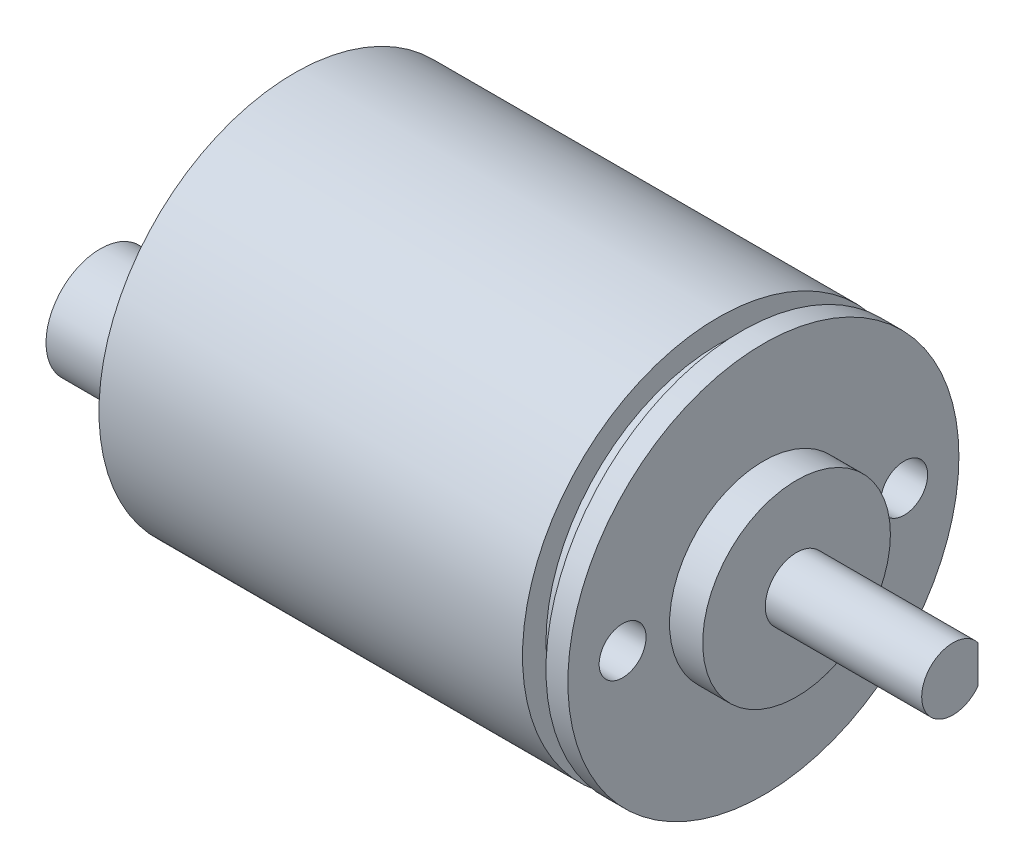
ISO-10303-21;
HEADER;
FILE_DESCRIPTION(('STEP AP214'),'2;1');
FILE_NAME('part.step','',(''),(''),'','','');
FILE_SCHEMA(('AUTOMOTIVE_DESIGN { 1 0 10303 214 1 1 1 1 }'));
ENDSEC;
DATA;
#1=APPLICATION_CONTEXT('core data for automotive mechanical design processes');
#2=APPLICATION_PROTOCOL_DEFINITION('international standard','automotive_design',2000,#1);
#3=PRODUCT_CONTEXT('',#1,'mechanical');
#4=PRODUCT('Part','Part','',(#3));
#5=PRODUCT_RELATED_PRODUCT_CATEGORY('part','',(#4));
#6=PRODUCT_DEFINITION_FORMATION('','',#4);
#7=PRODUCT_DEFINITION_CONTEXT('part definition',#1,'design');
#8=PRODUCT_DEFINITION('design','',#6,#7);
#9=PRODUCT_DEFINITION_SHAPE('','',#8);
#10=(LENGTH_UNIT() NAMED_UNIT(*) SI_UNIT(.MILLI.,.METRE.));
#11=(NAMED_UNIT(*) PLANE_ANGLE_UNIT() SI_UNIT($,.RADIAN.));
#12=(NAMED_UNIT(*) SI_UNIT($,.STERADIAN.) SOLID_ANGLE_UNIT());
#13=UNCERTAINTY_MEASURE_WITH_UNIT(LENGTH_MEASURE(1.E-05),#10,'distance_accuracy_value','');
#14=(GEOMETRIC_REPRESENTATION_CONTEXT(3) GLOBAL_UNCERTAINTY_ASSIGNED_CONTEXT((#13)) GLOBAL_UNIT_ASSIGNED_CONTEXT((#10,
#11,#12)) REPRESENTATION_CONTEXT('',''));
#15=CARTESIAN_POINT('',(0.,0.,0.));
#16=DIRECTION('',(0.,0.,1.));
#17=DIRECTION('',(1.,0.,0.));
#18=AXIS2_PLACEMENT_3D('',#15,#16,#17);
#19=CARTESIAN_POINT('',(0.,0.,0.));
#20=DIRECTION('',(1.,0.,0.));
#21=DIRECTION('',(0.,0.,-1.));
#22=AXIS2_PLACEMENT_3D('',#19,#20,#21);
#23=PLANE('',#22);
#24=CARTESIAN_POINT('',(0.,0.,0.));
#25=DIRECTION('',(1.,0.,0.));
#26=DIRECTION('',(0.,0.,-1.));
#27=AXIS2_PLACEMENT_3D('',#24,#25,#26);
#28=CIRCLE('',#27,12.5);
#29=CARTESIAN_POINT('',(0.,0.,-12.5));
#30=VERTEX_POINT('',#29);
#31=EDGE_CURVE('E97',#30,#30,#28,.T.);
#32=ORIENTED_EDGE('',*,*,#31,.F.);
#33=EDGE_LOOP('',(#32));
#34=FACE_BOUND('',#33,.T.);
#35=CARTESIAN_POINT('',(0.,0.,6.91455735606405));
#36=DIRECTION('',(1.,0.,0.));
#37=DIRECTION('',(0.,0.,-1.));
#38=AXIS2_PLACEMENT_3D('',#35,#36,#37);
#39=CIRCLE('',#38,3.47136815867395);
#40=CARTESIAN_POINT('',(0.,0.,3.44318919739011));
#41=VERTEX_POINT('',#40);
#42=EDGE_CURVE('E11',#41,#41,#39,.F.);
#43=ORIENTED_EDGE('',*,*,#42,.F.);
#44=EDGE_LOOP('',(#43));
#45=FACE_BOUND('',#44,.T.);
#46=ADVANCED_FACE('F34',(#34,#45),#23,.F.);
#47=CARTESIAN_POINT('',(32.0964,0.,0.));
#48=DIRECTION('',(1.,0.,0.));
#49=DIRECTION('',(0.,0.,-1.));
#50=AXIS2_PLACEMENT_3D('',#47,#48,#49);
#51=PLANE('',#50);
#52=CARTESIAN_POINT('',(32.0964,0.,0.));
#53=DIRECTION('',(1.,0.,0.));
#54=DIRECTION('',(0.,0.,-1.));
#55=AXIS2_PLACEMENT_3D('',#52,#53,#54);
#56=CIRCLE('',#55,6.);
#57=CARTESIAN_POINT('',(32.0964,0.,-6.));
#58=VERTEX_POINT('',#57);
#59=EDGE_CURVE('E79',#58,#58,#56,.T.);
#60=ORIENTED_EDGE('',*,*,#59,.T.);
#61=EDGE_LOOP('',(#60));
#62=FACE_BOUND('',#61,.T.);
#63=CARTESIAN_POINT('',(32.0964,0.,0.));
#64=DIRECTION('',(1.,0.,0.));
#65=DIRECTION('',(0.,0.,-1.));
#66=AXIS2_PLACEMENT_3D('',#63,#64,#65);
#67=CIRCLE('',#66,2.);
#68=CARTESIAN_POINT('',(32.0964,0.,-2.));
#69=VERTEX_POINT('',#68);
#70=EDGE_CURVE('E76',#69,#69,#67,.T.);
#71=ORIENTED_EDGE('',*,*,#70,.F.);
#72=EDGE_LOOP('',(#71));
#73=FACE_BOUND('',#72,.T.);
#74=ADVANCED_FACE('F133',(#62,#73),#51,.T.);
#75=CARTESIAN_POINT('',(29.9764,0.,0.));
#76=DIRECTION('',(1.,0.,0.));
#77=DIRECTION('',(0.,0.,-1.));
#78=AXIS2_PLACEMENT_3D('',#75,#76,#77);
#79=PLANE('',#78);
#80=CARTESIAN_POINT('',(29.9764,0.,9.));
#81=DIRECTION('',(1.,0.,0.));
#82=DIRECTION('',(0.,0.,-1.));
#83=AXIS2_PLACEMENT_3D('',#80,#81,#82);
#84=CIRCLE('',#83,1.5);
#85=CARTESIAN_POINT('',(29.9764,0.,7.5));
#86=VERTEX_POINT('',#85);
#87=EDGE_CURVE('E114',#86,#86,#84,.T.);
#88=ORIENTED_EDGE('',*,*,#87,.F.);
#89=EDGE_LOOP('',(#88));
#90=FACE_BOUND('',#89,.T.);
#91=CARTESIAN_POINT('',(29.9764,0.,-9.));
#92=DIRECTION('',(1.,0.,0.));
#93=DIRECTION('',(0.,0.,-1.));
#94=AXIS2_PLACEMENT_3D('',#91,#92,#93);
#95=CIRCLE('',#94,1.5);
#96=CARTESIAN_POINT('',(29.9764,0.,-10.5));
#97=VERTEX_POINT('',#96);
#98=EDGE_CURVE('E108',#97,#97,#95,.T.);
#99=ORIENTED_EDGE('',*,*,#98,.F.);
#100=EDGE_LOOP('',(#99));
#101=FACE_BOUND('',#100,.T.);
#102=CARTESIAN_POINT('',(29.9764,0.,0.));
#103=DIRECTION('',(1.,0.,0.));
#104=DIRECTION('',(0.,0.,-1.));
#105=AXIS2_PLACEMENT_3D('',#102,#103,#104);
#106=CIRCLE('',#105,12.5);
#107=CARTESIAN_POINT('',(29.9764,0.,-12.5));
#108=VERTEX_POINT('',#107);
#109=EDGE_CURVE('E88',#108,#108,#106,.T.);
#110=ORIENTED_EDGE('',*,*,#109,.T.);
#111=EDGE_LOOP('',(#110));
#112=FACE_BOUND('',#111,.T.);
#113=CARTESIAN_POINT('',(29.9764,0.,0.));
#114=DIRECTION('',(1.,0.,0.));
#115=DIRECTION('',(0.,0.,-1.));
#116=AXIS2_PLACEMENT_3D('',#113,#114,#115);
#117=CIRCLE('',#116,6.);
#118=CARTESIAN_POINT('',(29.9764,0.,-6.));
#119=VERTEX_POINT('',#118);
#120=EDGE_CURVE('E75',#119,#119,#117,.T.);
#121=ORIENTED_EDGE('',*,*,#120,.F.);
#122=EDGE_LOOP('',(#121));
#123=FACE_BOUND('',#122,.T.);
#124=ADVANCED_FACE('F138',(#90,#101,#112,#123),#79,.T.);
#125=CARTESIAN_POINT('',(27.0764,0.,0.));
#126=DIRECTION('',(1.,0.,0.));
#127=DIRECTION('',(0.,0.,-1.));
#128=AXIS2_PLACEMENT_3D('',#125,#126,#127);
#129=PLANE('',#128);
#130=CARTESIAN_POINT('',(27.0764,0.,0.));
#131=DIRECTION('',(1.,0.,0.));
#132=DIRECTION('',(0.,0.,-1.));
#133=AXIS2_PLACEMENT_3D('',#130,#131,#132);
#134=CIRCLE('',#133,12.5);
#135=CARTESIAN_POINT('',(27.0764,0.,-12.5));
#136=VERTEX_POINT('',#135);
#137=EDGE_CURVE('E65',#136,#136,#134,.T.);
#138=ORIENTED_EDGE('',*,*,#137,.T.);
#139=EDGE_LOOP('',(#138));
#140=FACE_BOUND('',#139,.T.);
#141=CARTESIAN_POINT('',(27.0764,0.,0.));
#142=DIRECTION('',(1.,0.,0.));
#143=DIRECTION('',(0.,0.,-1.));
#144=AXIS2_PLACEMENT_3D('',#141,#142,#143);
#145=CIRCLE('',#144,11.);
#146=CARTESIAN_POINT('',(27.0764,0.,-11.));
#147=VERTEX_POINT('',#146);
#148=EDGE_CURVE('E91',#147,#147,#145,.T.);
#149=ORIENTED_EDGE('',*,*,#148,.F.);
#150=EDGE_LOOP('',(#149));
#151=FACE_BOUND('',#150,.T.);
#152=ADVANCED_FACE('F143',(#140,#151),#129,.T.);
#153=CARTESIAN_POINT('',(27.0764,0.,0.));
#154=DIRECTION('',(-1.,0.,0.));
#155=DIRECTION('',(0.,0.,1.));
#156=AXIS2_PLACEMENT_3D('',#153,#154,#155);
#157=CYLINDRICAL_SURFACE('',#156,12.5);
#158=ORIENTED_EDGE('',*,*,#137,.F.);
#159=EDGE_LOOP('',(#158));
#160=FACE_BOUND('',#159,.T.);
#161=ORIENTED_EDGE('',*,*,#31,.T.);
#162=EDGE_LOOP('',(#161));
#163=FACE_BOUND('',#162,.T.);
#164=ADVANCED_FACE('F36',(#160,#163),#157,.T.);
#165=CARTESIAN_POINT('',(28.5764,0.,0.));
#166=DIRECTION('',(-1.,0.,0.));
#167=DIRECTION('',(0.,0.,1.));
#168=AXIS2_PLACEMENT_3D('',#165,#166,#167);
#169=CYLINDRICAL_SURFACE('',#168,11.);
#170=CARTESIAN_POINT('',(28.5764,0.,0.));
#171=DIRECTION('',(1.,0.,0.));
#172=DIRECTION('',(0.,0.,-1.));
#173=AXIS2_PLACEMENT_3D('',#170,#171,#172);
#174=CIRCLE('',#173,11.);
#175=CARTESIAN_POINT('',(28.5764,0.,-11.));
#176=VERTEX_POINT('',#175);
#177=EDGE_CURVE('E94',#176,#176,#174,.T.);
#178=ORIENTED_EDGE('',*,*,#177,.F.);
#179=EDGE_LOOP('',(#178));
#180=FACE_BOUND('',#179,.T.);
#181=ORIENTED_EDGE('',*,*,#148,.T.);
#182=EDGE_LOOP('',(#181));
#183=FACE_BOUND('',#182,.T.);
#184=ADVANCED_FACE('F147',(#180,#183),#169,.T.);
#185=CARTESIAN_POINT('',(28.5764,0.,0.));
#186=DIRECTION('',(1.,0.,0.));
#187=DIRECTION('',(0.,0.,-1.));
#188=AXIS2_PLACEMENT_3D('',#185,#186,#187);
#189=PLANE('',#188);
#190=CARTESIAN_POINT('',(28.5764,0.,0.));
#191=DIRECTION('',(1.,0.,0.));
#192=DIRECTION('',(0.,0.,-1.));
#193=AXIS2_PLACEMENT_3D('',#190,#191,#192);
#194=CIRCLE('',#193,12.5);
#195=CARTESIAN_POINT('',(28.5764,0.,-12.5));
#196=VERTEX_POINT('',#195);
#197=EDGE_CURVE('E86',#196,#196,#194,.T.);
#198=ORIENTED_EDGE('',*,*,#197,.F.);
#199=EDGE_LOOP('',(#198));
#200=FACE_BOUND('',#199,.T.);
#201=ORIENTED_EDGE('',*,*,#177,.T.);
#202=EDGE_LOOP('',(#201));
#203=FACE_BOUND('',#202,.T.);
#204=ADVANCED_FACE('F150',(#200,#203),#189,.F.);
#205=CARTESIAN_POINT('',(29.9764,0.,0.));
#206=DIRECTION('',(-1.,0.,0.));
#207=DIRECTION('',(0.,0.,1.));
#208=AXIS2_PLACEMENT_3D('',#205,#206,#207);
#209=CYLINDRICAL_SURFACE('',#208,12.5);
#210=ORIENTED_EDGE('',*,*,#109,.F.);
#211=EDGE_LOOP('',(#210));
#212=FACE_BOUND('',#211,.T.);
#213=ORIENTED_EDGE('',*,*,#197,.T.);
#214=EDGE_LOOP('',(#213));
#215=FACE_BOUND('',#214,.T.);
#216=ADVANCED_FACE('F152',(#212,#215),#209,.T.);
#217=CARTESIAN_POINT('',(32.0964,0.,0.));
#218=DIRECTION('',(-1.,0.,0.));
#219=DIRECTION('',(0.,0.,1.));
#220=AXIS2_PLACEMENT_3D('',#217,#218,#219);
#221=CYLINDRICAL_SURFACE('',#220,6.);
#222=ORIENTED_EDGE('',*,*,#59,.F.);
#223=EDGE_LOOP('',(#222));
#224=FACE_BOUND('',#223,.T.);
#225=ORIENTED_EDGE('',*,*,#120,.T.);
#226=EDGE_LOOP('',(#225));
#227=FACE_BOUND('',#226,.T.);
#228=ADVANCED_FACE('F155',(#224,#227),#221,.T.);
#229=CARTESIAN_POINT('',(42.0964,0.,0.));
#230=DIRECTION('',(-1.,0.,0.));
#231=DIRECTION('',(0.,0.,1.));
#232=AXIS2_PLACEMENT_3D('',#229,#230,#231);
#233=CYLINDRICAL_SURFACE('',#232,2.);
#234=CARTESIAN_POINT('',(42.0964,0.,0.));
#235=DIRECTION('',(1.,0.,0.));
#236=DIRECTION('',(0.,0.,-1.));
#237=AXIS2_PLACEMENT_3D('',#234,#235,#236);
#238=CIRCLE('',#237,2.);
#239=CARTESIAN_POINT('',(42.0964,1.2,-1.6));
#240=VERTEX_POINT('',#239);
#241=CARTESIAN_POINT('',(42.0964,-1.2,-1.6));
#242=VERTEX_POINT('',#241);
#243=EDGE_CURVE('E71',#240,#242,#238,.T.);
#244=ORIENTED_EDGE('',*,*,#243,.F.);
#245=DIRECTION('',(-1.,0.,0.));
#246=VECTOR('',#245,1.);
#247=CARTESIAN_POINT('',(42.0964,1.2,-1.6));
#248=LINE('',#247,#246);
#249=CARTESIAN_POINT('',(34.0964,1.2,-1.6));
#250=VERTEX_POINT('',#249);
#251=EDGE_CURVE('E49',#240,#250,#248,.T.);
#252=ORIENTED_EDGE('',*,*,#251,.T.);
#253=CARTESIAN_POINT('',(34.0964,0.,0.));
#254=DIRECTION('',(1.,0.,0.));
#255=DIRECTION('',(0.,0.,-1.));
#256=AXIS2_PLACEMENT_3D('',#253,#254,#255);
#257=CIRCLE('',#256,2.);
#258=CARTESIAN_POINT('',(34.0964,-1.2,-1.6));
#259=VERTEX_POINT('',#258);
#260=EDGE_CURVE('E42',#259,#250,#257,.T.);
#261=ORIENTED_EDGE('',*,*,#260,.F.);
#262=DIRECTION('',(-1.,0.,0.));
#263=VECTOR('',#262,1.);
#264=CARTESIAN_POINT('',(42.0964,-1.2,-1.6));
#265=LINE('',#264,#263);
#266=EDGE_CURVE('E54',#259,#242,#265,.F.);
#267=ORIENTED_EDGE('',*,*,#266,.T.);
#268=EDGE_LOOP('',(#244,#252,#261,#267));
#269=FACE_BOUND('',#268,.T.);
#270=ORIENTED_EDGE('',*,*,#70,.T.);
#271=EDGE_LOOP('',(#270));
#272=FACE_BOUND('',#271,.T.);
#273=ADVANCED_FACE('F69',(#269,#272),#233,.T.);
#274=CARTESIAN_POINT('',(42.0964,0.,0.));
#275=DIRECTION('',(1.,0.,0.));
#276=DIRECTION('',(0.,0.,-1.));
#277=AXIS2_PLACEMENT_3D('',#274,#275,#276);
#278=PLANE('',#277);
#279=DIRECTION('',(0.,-1.,0.));
#280=VECTOR('',#279,1.);
#281=CARTESIAN_POINT('',(42.0964,0.,-1.6));
#282=LINE('',#281,#280);
#283=EDGE_CURVE('E60',#240,#242,#282,.T.);
#284=ORIENTED_EDGE('',*,*,#283,.F.);
#285=ORIENTED_EDGE('',*,*,#243,.T.);
#286=EDGE_LOOP('',(#284,#285));
#287=FACE_BOUND('',#286,.T.);
#288=ADVANCED_FACE('F74',(#287),#278,.T.);
#289=CARTESIAN_POINT('',(34.0964,-3.39264034417219,-1.6));
#290=DIRECTION('',(1.,0.,0.));
#291=DIRECTION('',(0.,0.,-1.));
#292=AXIS2_PLACEMENT_3D('',#289,#290,#291);
#293=PLANE('',#292);
#294=ORIENTED_EDGE('',*,*,#260,.T.);
#295=DIRECTION('',(0.,-1.,0.));
#296=VECTOR('',#295,1.);
#297=CARTESIAN_POINT('',(34.0964,3.27174151376575,-1.6));
#298=LINE('',#297,#296);
#299=EDGE_CURVE('E72',#250,#259,#298,.T.);
#300=ORIENTED_EDGE('',*,*,#299,.T.);
#301=EDGE_LOOP('',(#294,#300));
#302=FACE_BOUND('',#301,.T.);
#303=ADVANCED_FACE('F104',(#302),#293,.T.);
#304=CARTESIAN_POINT('',(34.0964,3.27174151376575,-1.6));
#305=DIRECTION('',(0.,0.,1.));
#306=DIRECTION('',(0.,-1.,0.));
#307=AXIS2_PLACEMENT_3D('',#304,#305,#306);
#308=PLANE('',#307);
#309=ORIENTED_EDGE('',*,*,#283,.T.);
#310=ORIENTED_EDGE('',*,*,#266,.F.);
#311=ORIENTED_EDGE('',*,*,#299,.F.);
#312=ORIENTED_EDGE('',*,*,#251,.F.);
#313=EDGE_LOOP('',(#309,#310,#311,#312));
#314=FACE_BOUND('',#313,.T.);
#315=ADVANCED_FACE('F61',(#314),#308,.F.);
#316=CARTESIAN_POINT('',(23.6264,0.,-9.));
#317=DIRECTION('',(1.,0.,0.));
#318=DIRECTION('',(0.,0.,-1.));
#319=AXIS2_PLACEMENT_3D('',#316,#317,#318);
#320=CYLINDRICAL_SURFACE('',#319,1.5);
#321=CARTESIAN_POINT('',(23.6264,0.,-9.));
#322=DIRECTION('',(1.,0.,0.));
#323=DIRECTION('',(0.,0.,-1.));
#324=AXIS2_PLACEMENT_3D('',#321,#322,#323);
#325=CIRCLE('',#324,1.5);
#326=CARTESIAN_POINT('',(23.6264,0.,-10.5));
#327=VERTEX_POINT('',#326);
#328=EDGE_CURVE('E105',#327,#327,#325,.T.);
#329=ORIENTED_EDGE('',*,*,#328,.F.);
#330=EDGE_LOOP('',(#329));
#331=FACE_BOUND('',#330,.T.);
#332=ORIENTED_EDGE('',*,*,#98,.T.);
#333=EDGE_LOOP('',(#332));
#334=FACE_BOUND('',#333,.T.);
#335=ADVANCED_FACE('F172',(#331,#334),#320,.F.);
#336=CARTESIAN_POINT('',(23.6264,0.,-9.));
#337=DIRECTION('',(1.,0.,0.));
#338=DIRECTION('',(0.,0.,-1.));
#339=AXIS2_PLACEMENT_3D('',#336,#337,#338);
#340=PLANE('',#339);
#341=ORIENTED_EDGE('',*,*,#328,.T.);
#342=EDGE_LOOP('',(#341));
#343=FACE_BOUND('',#342,.T.);
#344=ADVANCED_FACE('F177',(#343),#340,.T.);
#345=CARTESIAN_POINT('',(23.6264,0.,9.));
#346=DIRECTION('',(1.,0.,0.));
#347=DIRECTION('',(0.,0.,-1.));
#348=AXIS2_PLACEMENT_3D('',#345,#346,#347);
#349=CYLINDRICAL_SURFACE('',#348,1.5);
#350=CARTESIAN_POINT('',(23.6264,0.,9.));
#351=DIRECTION('',(1.,0.,0.));
#352=DIRECTION('',(0.,0.,-1.));
#353=AXIS2_PLACEMENT_3D('',#350,#351,#352);
#354=CIRCLE('',#353,1.5);
#355=CARTESIAN_POINT('',(23.6264,0.,7.5));
#356=VERTEX_POINT('',#355);
#357=EDGE_CURVE('E112',#356,#356,#354,.T.);
#358=ORIENTED_EDGE('',*,*,#357,.F.);
#359=EDGE_LOOP('',(#358));
#360=FACE_BOUND('',#359,.T.);
#361=ORIENTED_EDGE('',*,*,#87,.T.);
#362=EDGE_LOOP('',(#361));
#363=FACE_BOUND('',#362,.T.);
#364=ADVANCED_FACE('F181',(#360,#363),#349,.F.);
#365=CARTESIAN_POINT('',(23.6264,0.,9.));
#366=DIRECTION('',(1.,0.,0.));
#367=DIRECTION('',(0.,0.,-1.));
#368=AXIS2_PLACEMENT_3D('',#365,#366,#367);
#369=PLANE('',#368);
#370=ORIENTED_EDGE('',*,*,#357,.T.);
#371=EDGE_LOOP('',(#370));
#372=FACE_BOUND('',#371,.T.);
#373=ADVANCED_FACE('F128',(#372),#369,.T.);
#374=CARTESIAN_POINT('',(-5.5,0.,6.91455735606405));
#375=DIRECTION('',(1.,0.,0.));
#376=DIRECTION('',(0.,0.,-1.));
#377=AXIS2_PLACEMENT_3D('',#374,#375,#376);
#378=CYLINDRICAL_SURFACE('',#377,3.47136815867395);
#379=CARTESIAN_POINT('',(-5.5,0.,6.91455735606405));
#380=DIRECTION('',(-1.,0.,0.));
#381=DIRECTION('',(0.,0.,1.));
#382=AXIS2_PLACEMENT_3D('',#379,#380,#381);
#383=CIRCLE('',#382,3.47136815867395);
#384=CARTESIAN_POINT('',(-5.5,0.,10.385925514738));
#385=VERTEX_POINT('',#384);
#386=EDGE_CURVE('E117',#385,#385,#383,.T.);
#387=ORIENTED_EDGE('',*,*,#386,.F.);
#388=EDGE_LOOP('',(#387));
#389=FACE_BOUND('',#388,.T.);
#390=ORIENTED_EDGE('',*,*,#42,.T.);
#391=EDGE_LOOP('',(#390));
#392=FACE_BOUND('',#391,.T.);
#393=ADVANCED_FACE('F125',(#389,#392),#378,.T.);
#394=CARTESIAN_POINT('',(-5.5,0.,6.91455735606405));
#395=DIRECTION('',(-1.,0.,0.));
#396=DIRECTION('',(0.,0.,1.));
#397=AXIS2_PLACEMENT_3D('',#394,#395,#396);
#398=PLANE('',#397);
#399=ORIENTED_EDGE('',*,*,#386,.T.);
#400=EDGE_LOOP('',(#399));
#401=FACE_BOUND('',#400,.T.);
#402=ADVANCED_FACE('F123',(#401),#398,.T.);
#403=CLOSED_SHELL('',(#46,#74,#124,#152,#164,#184,#204,#216,#228,#273,#288,#303,#315,#335,#344,
#364,#373,#393,#402));
#404=MANIFOLD_SOLID_BREP('B2',#403);
#405=ADVANCED_BREP_SHAPE_REPRESENTATION('',(#18,#404),#14);
#406=SHAPE_DEFINITION_REPRESENTATION(#9,#405);
ENDSEC;
END-ISO-10303-21;
